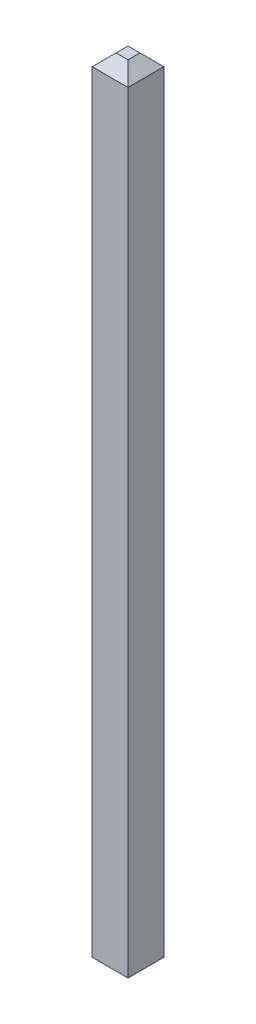
ISO-10303-21;
HEADER;
FILE_DESCRIPTION(('STEP AP214'),'2;1');
FILE_NAME('part.step','',(''),(''),'','','');
FILE_SCHEMA(('AUTOMOTIVE_DESIGN { 1 0 10303 214 1 1 1 1 }'));
ENDSEC;
DATA;
#1=APPLICATION_CONTEXT('core data for automotive mechanical design processes');
#2=APPLICATION_PROTOCOL_DEFINITION('international standard','automotive_design',2000,#1);
#3=PRODUCT_CONTEXT('',#1,'mechanical');
#4=PRODUCT('Part','Part','',(#3));
#5=PRODUCT_RELATED_PRODUCT_CATEGORY('part','',(#4));
#6=PRODUCT_DEFINITION_FORMATION('','',#4);
#7=PRODUCT_DEFINITION_CONTEXT('part definition',#1,'design');
#8=PRODUCT_DEFINITION('design','',#6,#7);
#9=PRODUCT_DEFINITION_SHAPE('','',#8);
#10=(LENGTH_UNIT() NAMED_UNIT(*) SI_UNIT(.MILLI.,.METRE.));
#11=(NAMED_UNIT(*) PLANE_ANGLE_UNIT() SI_UNIT($,.RADIAN.));
#12=(NAMED_UNIT(*) SI_UNIT($,.STERADIAN.) SOLID_ANGLE_UNIT());
#13=UNCERTAINTY_MEASURE_WITH_UNIT(LENGTH_MEASURE(1.E-05),#10,'distance_accuracy_value','');
#14=(GEOMETRIC_REPRESENTATION_CONTEXT(3) GLOBAL_UNCERTAINTY_ASSIGNED_CONTEXT((#13)) GLOBAL_UNIT_ASSIGNED_CONTEXT((#10,
#11,#12)) REPRESENTATION_CONTEXT('',''));
#15=CARTESIAN_POINT('',(0.,0.,0.));
#16=DIRECTION('',(0.,0.,1.));
#17=DIRECTION('',(1.,0.,0.));
#18=AXIS2_PLACEMENT_3D('',#15,#16,#17);
#19=CARTESIAN_POINT('',(0.,-8.3,0.));
#20=DIRECTION('',(0.,1.,0.));
#21=DIRECTION('',(0.,0.,1.));
#22=AXIS2_PLACEMENT_3D('',#19,#20,#21);
#23=PLANE('',#22);
#24=DIRECTION('',(-1.,0.,0.));
#25=VECTOR('',#24,1.);
#26=CARTESIAN_POINT('',(-1.55,-8.3,0.100000000000001));
#27=LINE('',#26,#25);
#28=CARTESIAN_POINT('',(-1.15,-8.3,0.100000000000001));
#29=VERTEX_POINT('',#28);
#30=CARTESIAN_POINT('',(-1.35,-8.3,0.100000000000001));
#31=VERTEX_POINT('',#30);
#32=EDGE_CURVE('E134',#29,#31,#27,.T.);
#33=ORIENTED_EDGE('',*,*,#32,.T.);
#34=DIRECTION('',(0.,0.,-1.));
#35=VECTOR('',#34,1.);
#36=CARTESIAN_POINT('',(-1.35,-8.3,-0.3));
#37=LINE('',#36,#35);
#38=CARTESIAN_POINT('',(-1.35,-8.3,-0.100000000000001));
#39=VERTEX_POINT('',#38);
#40=EDGE_CURVE('E118',#31,#39,#37,.T.);
#41=ORIENTED_EDGE('',*,*,#40,.T.);
#42=DIRECTION('',(1.,0.,0.));
#43=VECTOR('',#42,1.);
#44=CARTESIAN_POINT('',(-0.95,-8.3,-0.100000000000001));
#45=LINE('',#44,#43);
#46=CARTESIAN_POINT('',(-1.15,-8.3,-0.100000000000001));
#47=VERTEX_POINT('',#46);
#48=EDGE_CURVE('E123',#39,#47,#45,.T.);
#49=ORIENTED_EDGE('',*,*,#48,.T.);
#50=DIRECTION('',(0.,0.,1.));
#51=VECTOR('',#50,1.);
#52=CARTESIAN_POINT('',(-1.15,-8.3,0.3));
#53=LINE('',#52,#51);
#54=EDGE_CURVE('E136',#47,#29,#53,.T.);
#55=ORIENTED_EDGE('',*,*,#54,.T.);
#56=EDGE_LOOP('',(#33,#41,#49,#55));
#57=FACE_BOUND('',#56,.T.);
#58=ADVANCED_FACE('F33',(#57),#23,.F.);
#59=CARTESIAN_POINT('',(-1.55,-8.1,-0.3));
#60=DIRECTION('',(-0.707106781186551,-0.707106781186544,0.));
#61=DIRECTION('',(0.,0.,-1.));
#62=AXIS2_PLACEMENT_3D('',#59,#60,#61);
#63=PLANE('',#62);
#64=DIRECTION('',(-0.577350269189624,0.577350269189629,-0.577350269189624));
#65=VECTOR('',#64,1.);
#66=CARTESIAN_POINT('',(-1.55,-8.1,-0.3));
#67=LINE('',#66,#65);
#68=CARTESIAN_POINT('',(-1.55,-8.1,-0.3));
#69=VERTEX_POINT('',#68);
#70=EDGE_CURVE('E121',#69,#39,#67,.F.);
#71=ORIENTED_EDGE('',*,*,#70,.T.);
#72=ORIENTED_EDGE('',*,*,#40,.F.);
#73=DIRECTION('',(0.577350269189624,-0.577350269189629,-0.577350269189624));
#74=VECTOR('',#73,1.);
#75=CARTESIAN_POINT('',(-1.55,-8.1,0.3));
#76=LINE('',#75,#74);
#77=CARTESIAN_POINT('',(-1.55,-8.1,0.3));
#78=VERTEX_POINT('',#77);
#79=EDGE_CURVE('E128',#31,#78,#76,.F.);
#80=ORIENTED_EDGE('',*,*,#79,.T.);
#81=DIRECTION('',(0.,0.,1.));
#82=VECTOR('',#81,1.);
#83=CARTESIAN_POINT('',(-1.55,-8.1,0.3));
#84=LINE('',#83,#82);
#85=EDGE_CURVE('E102',#69,#78,#84,.T.);
#86=ORIENTED_EDGE('',*,*,#85,.F.);
#87=EDGE_LOOP('',(#71,#72,#80,#86));
#88=FACE_BOUND('',#87,.T.);
#89=ADVANCED_FACE('F131',(#88),#63,.T.);
#90=CARTESIAN_POINT('',(-1.55,-8.1,0.3));
#91=DIRECTION('',(0.,-0.707106781186544,0.707106781186551));
#92=DIRECTION('',(-1.,0.,0.));
#93=AXIS2_PLACEMENT_3D('',#90,#91,#92);
#94=PLANE('',#93);
#95=DIRECTION('',(0.577350269189624,0.577350269189629,0.577350269189624));
#96=VECTOR('',#95,1.);
#97=CARTESIAN_POINT('',(-1.15,-8.3,0.100000000000001));
#98=LINE('',#97,#96);
#99=CARTESIAN_POINT('',(-0.95,-8.1,0.3));
#100=VERTEX_POINT('',#99);
#101=EDGE_CURVE('E127',#29,#100,#98,.T.);
#102=ORIENTED_EDGE('',*,*,#101,.T.);
#103=DIRECTION('',(1.,0.,0.));
#104=VECTOR('',#103,1.);
#105=CARTESIAN_POINT('',(-0.95,-8.1,0.3));
#106=LINE('',#105,#104);
#107=EDGE_CURVE('E146',#78,#100,#106,.T.);
#108=ORIENTED_EDGE('',*,*,#107,.F.);
#109=ORIENTED_EDGE('',*,*,#79,.F.);
#110=ORIENTED_EDGE('',*,*,#32,.F.);
#111=EDGE_LOOP('',(#102,#108,#109,#110));
#112=FACE_BOUND('',#111,.T.);
#113=ADVANCED_FACE('F200',(#112),#94,.T.);
#114=CARTESIAN_POINT('',(-0.95,-8.1,-0.3));
#115=DIRECTION('',(0.707106781186551,-0.707106781186544,0.));
#116=DIRECTION('',(0.,0.,1.));
#117=AXIS2_PLACEMENT_3D('',#114,#115,#116);
#118=PLANE('',#117);
#119=ORIENTED_EDGE('',*,*,#101,.F.);
#120=ORIENTED_EDGE('',*,*,#54,.F.);
#121=DIRECTION('',(0.577350269189624,0.577350269189629,-0.577350269189624));
#122=VECTOR('',#121,1.);
#123=CARTESIAN_POINT('',(-0.95,-8.1,-0.3));
#124=LINE('',#123,#122);
#125=CARTESIAN_POINT('',(-0.95,-8.1,-0.3));
#126=VERTEX_POINT('',#125);
#127=EDGE_CURVE('E165',#126,#47,#124,.F.);
#128=ORIENTED_EDGE('',*,*,#127,.F.);
#129=DIRECTION('',(0.,0.,-1.));
#130=VECTOR('',#129,1.);
#131=CARTESIAN_POINT('',(-0.95,-8.1,-0.3));
#132=LINE('',#131,#130);
#133=EDGE_CURVE('E117',#100,#126,#132,.T.);
#134=ORIENTED_EDGE('',*,*,#133,.F.);
#135=EDGE_LOOP('',(#119,#120,#128,#134));
#136=FACE_BOUND('',#135,.T.);
#137=ADVANCED_FACE('F197',(#136),#118,.T.);
#138=CARTESIAN_POINT('',(-1.55,-8.1,-0.3));
#139=DIRECTION('',(0.,-0.707106781186544,-0.707106781186551));
#140=DIRECTION('',(1.,0.,0.));
#141=AXIS2_PLACEMENT_3D('',#138,#139,#140);
#142=PLANE('',#141);
#143=ORIENTED_EDGE('',*,*,#127,.T.);
#144=ORIENTED_EDGE('',*,*,#48,.F.);
#145=ORIENTED_EDGE('',*,*,#70,.F.);
#146=DIRECTION('',(-1.,0.,0.));
#147=VECTOR('',#146,1.);
#148=CARTESIAN_POINT('',(-1.55,-8.1,-0.3));
#149=LINE('',#148,#147);
#150=EDGE_CURVE('E111',#126,#69,#149,.T.);
#151=ORIENTED_EDGE('',*,*,#150,.F.);
#152=EDGE_LOOP('',(#143,#144,#145,#151));
#153=FACE_BOUND('',#152,.T.);
#154=ADVANCED_FACE('F122',(#153),#142,.T.);
#155=CARTESIAN_POINT('',(-1.55,-8.3,-0.3));
#156=DIRECTION('',(0.,0.,-1.));
#157=DIRECTION('',(-1.,0.,0.));
#158=AXIS2_PLACEMENT_3D('',#155,#156,#157);
#159=PLANE('',#158);
#160=DIRECTION('',(0.,1.,0.));
#161=VECTOR('',#160,1.);
#162=CARTESIAN_POINT('',(-0.95,-8.3,-0.3));
#163=LINE('',#162,#161);
#164=CARTESIAN_POINT('',(-0.95,4.8,-0.3));
#165=VERTEX_POINT('',#164);
#166=EDGE_CURVE('E108',#126,#165,#163,.T.);
#167=ORIENTED_EDGE('',*,*,#166,.F.);
#168=ORIENTED_EDGE('',*,*,#150,.T.);
#169=DIRECTION('',(0.,1.,0.));
#170=VECTOR('',#169,1.);
#171=CARTESIAN_POINT('',(-1.55,-8.3,-0.3));
#172=LINE('',#171,#170);
#173=CARTESIAN_POINT('',(-1.55,4.8,-0.3));
#174=VERTEX_POINT('',#173);
#175=EDGE_CURVE('E98',#69,#174,#172,.T.);
#176=ORIENTED_EDGE('',*,*,#175,.T.);
#177=DIRECTION('',(1.,0.,0.));
#178=VECTOR('',#177,1.);
#179=CARTESIAN_POINT('',(-1.55,4.8,-0.3));
#180=LINE('',#179,#178);
#181=EDGE_CURVE('E158',#174,#165,#180,.T.);
#182=ORIENTED_EDGE('',*,*,#181,.T.);
#183=EDGE_LOOP('',(#167,#168,#176,#182));
#184=FACE_BOUND('',#183,.T.);
#185=ADVANCED_FACE('F113',(#184),#159,.T.);
#186=CARTESIAN_POINT('',(-0.95,-8.3,-0.3));
#187=DIRECTION('',(1.,0.,0.));
#188=DIRECTION('',(0.,0.,-1.));
#189=AXIS2_PLACEMENT_3D('',#186,#187,#188);
#190=PLANE('',#189);
#191=DIRECTION('',(0.,1.,0.));
#192=VECTOR('',#191,1.);
#193=CARTESIAN_POINT('',(-0.95,-8.3,0.3));
#194=LINE('',#193,#192);
#195=CARTESIAN_POINT('',(-0.95,4.8,0.3));
#196=VERTEX_POINT('',#195);
#197=EDGE_CURVE('E191',#100,#196,#194,.T.);
#198=ORIENTED_EDGE('',*,*,#197,.F.);
#199=ORIENTED_EDGE('',*,*,#133,.T.);
#200=ORIENTED_EDGE('',*,*,#166,.T.);
#201=DIRECTION('',(0.,0.,1.));
#202=VECTOR('',#201,1.);
#203=CARTESIAN_POINT('',(-0.95,4.8,-0.3));
#204=LINE('',#203,#202);
#205=EDGE_CURVE('E11',#165,#196,#204,.T.);
#206=ORIENTED_EDGE('',*,*,#205,.T.);
#207=EDGE_LOOP('',(#198,#199,#200,#206));
#208=FACE_BOUND('',#207,.T.);
#209=ADVANCED_FACE('F188',(#208),#190,.T.);
#210=CARTESIAN_POINT('',(-1.55,-8.3,0.3));
#211=DIRECTION('',(0.,0.,1.));
#212=DIRECTION('',(1.,0.,0.));
#213=AXIS2_PLACEMENT_3D('',#210,#211,#212);
#214=PLANE('',#213);
#215=DIRECTION('',(0.,1.,0.));
#216=VECTOR('',#215,1.);
#217=CARTESIAN_POINT('',(-1.55,-8.3,0.3));
#218=LINE('',#217,#216);
#219=CARTESIAN_POINT('',(-1.55,4.8,0.3));
#220=VERTEX_POINT('',#219);
#221=EDGE_CURVE('E139',#78,#220,#218,.T.);
#222=ORIENTED_EDGE('',*,*,#221,.F.);
#223=ORIENTED_EDGE('',*,*,#107,.T.);
#224=ORIENTED_EDGE('',*,*,#197,.T.);
#225=DIRECTION('',(-1.,0.,0.));
#226=VECTOR('',#225,1.);
#227=CARTESIAN_POINT('',(-1.55,4.8,0.3));
#228=LINE('',#227,#226);
#229=EDGE_CURVE('E42',#196,#220,#228,.T.);
#230=ORIENTED_EDGE('',*,*,#229,.T.);
#231=EDGE_LOOP('',(#222,#223,#224,#230));
#232=FACE_BOUND('',#231,.T.);
#233=ADVANCED_FACE('F193',(#232),#214,.T.);
#234=CARTESIAN_POINT('',(-1.55,-8.3,-0.3));
#235=DIRECTION('',(-1.,0.,0.));
#236=DIRECTION('',(0.,0.,1.));
#237=AXIS2_PLACEMENT_3D('',#234,#235,#236);
#238=PLANE('',#237);
#239=ORIENTED_EDGE('',*,*,#175,.F.);
#240=ORIENTED_EDGE('',*,*,#85,.T.);
#241=ORIENTED_EDGE('',*,*,#221,.T.);
#242=DIRECTION('',(0.,0.,-1.));
#243=VECTOR('',#242,1.);
#244=CARTESIAN_POINT('',(-1.55,4.8,-0.3));
#245=LINE('',#244,#243);
#246=EDGE_CURVE('E104',#220,#174,#245,.T.);
#247=ORIENTED_EDGE('',*,*,#246,.T.);
#248=EDGE_LOOP('',(#239,#240,#241,#247));
#249=FACE_BOUND('',#248,.T.);
#250=ADVANCED_FACE('F100',(#249),#238,.T.);
#251=CARTESIAN_POINT('',(0.,5.,0.));
#252=DIRECTION('',(0.,1.,0.));
#253=DIRECTION('',(0.,0.,1.));
#254=AXIS2_PLACEMENT_3D('',#251,#252,#253);
#255=PLANE('',#254);
#256=DIRECTION('',(0.,0.,-1.));
#257=VECTOR('',#256,1.);
#258=CARTESIAN_POINT('',(-1.15,5.,0.));
#259=LINE('',#258,#257);
#260=CARTESIAN_POINT('',(-1.15,5.,0.0999999999999995));
#261=VERTEX_POINT('',#260);
#262=CARTESIAN_POINT('',(-1.15,5.,-0.0999999999999995));
#263=VERTEX_POINT('',#262);
#264=EDGE_CURVE('E149',#261,#263,#259,.T.);
#265=ORIENTED_EDGE('',*,*,#264,.T.);
#266=DIRECTION('',(-1.,0.,0.));
#267=VECTOR('',#266,1.);
#268=CARTESIAN_POINT('',(0.,5.,-0.0999999999999995));
#269=LINE('',#268,#267);
#270=CARTESIAN_POINT('',(-1.35,5.,-0.0999999999999995));
#271=VERTEX_POINT('',#270);
#272=EDGE_CURVE('E155',#263,#271,#269,.T.);
#273=ORIENTED_EDGE('',*,*,#272,.T.);
#274=DIRECTION('',(0.,0.,1.));
#275=VECTOR('',#274,1.);
#276=CARTESIAN_POINT('',(-1.35,5.,0.));
#277=LINE('',#276,#275);
#278=CARTESIAN_POINT('',(-1.35,5.,0.0999999999999995));
#279=VERTEX_POINT('',#278);
#280=EDGE_CURVE('E153',#271,#279,#277,.T.);
#281=ORIENTED_EDGE('',*,*,#280,.T.);
#282=DIRECTION('',(1.,0.,0.));
#283=VECTOR('',#282,1.);
#284=CARTESIAN_POINT('',(0.,5.,0.0999999999999995));
#285=LINE('',#284,#283);
#286=EDGE_CURVE('E151',#279,#261,#285,.T.);
#287=ORIENTED_EDGE('',*,*,#286,.T.);
#288=EDGE_LOOP('',(#265,#273,#281,#287));
#289=FACE_BOUND('',#288,.T.);
#290=ADVANCED_FACE('F211',(#289),#255,.T.);
#291=CARTESIAN_POINT('',(0.,5.,0.0999999999999995));
#292=DIRECTION('',(0.,-0.707106781186549,-0.707106781186546));
#293=DIRECTION('',(1.,0.,0.));
#294=AXIS2_PLACEMENT_3D('',#291,#292,#293);
#295=PLANE('',#294);
#296=DIRECTION('',(-0.577350269189627,-0.577350269189624,0.577350269189627));
#297=VECTOR('',#296,1.);
#298=CARTESIAN_POINT('',(-0.899999999999998,5.45,-0.350000000000001));
#299=LINE('',#298,#297);
#300=EDGE_CURVE('E170',#220,#279,#299,.F.);
#301=ORIENTED_EDGE('',*,*,#300,.F.);
#302=ORIENTED_EDGE('',*,*,#229,.F.);
#303=DIRECTION('',(0.577350269189627,-0.577350269189624,0.577350269189627));
#304=VECTOR('',#303,1.);
#305=CARTESIAN_POINT('',(-1.18333333333333,5.03333333333333,0.0666666666666663));
#306=LINE('',#305,#304);
#307=EDGE_CURVE('E37',#261,#196,#306,.T.);
#308=ORIENTED_EDGE('',*,*,#307,.F.);
#309=ORIENTED_EDGE('',*,*,#286,.F.);
#310=EDGE_LOOP('',(#301,#302,#308,#309));
#311=FACE_BOUND('',#310,.T.);
#312=ADVANCED_FACE('F35',(#311),#295,.F.);
#313=CARTESIAN_POINT('',(-1.15,5.,0.));
#314=DIRECTION('',(-0.707106781186546,-0.707106781186549,0.));
#315=DIRECTION('',(0.,0.,-1.));
#316=AXIS2_PLACEMENT_3D('',#313,#314,#315);
#317=PLANE('',#316);
#318=ORIENTED_EDGE('',*,*,#307,.T.);
#319=ORIENTED_EDGE('',*,*,#205,.F.);
#320=DIRECTION('',(-0.577350269189627,0.577350269189624,0.577350269189627));
#321=VECTOR('',#320,1.);
#322=CARTESIAN_POINT('',(-1.18333333333333,5.03333333333333,-0.0666666666666662));
#323=LINE('',#322,#321);
#324=EDGE_CURVE('E169',#263,#165,#323,.F.);
#325=ORIENTED_EDGE('',*,*,#324,.F.);
#326=ORIENTED_EDGE('',*,*,#264,.F.);
#327=EDGE_LOOP('',(#318,#319,#325,#326));
#328=FACE_BOUND('',#327,.T.);
#329=ADVANCED_FACE('F179',(#328),#317,.F.);
#330=CARTESIAN_POINT('',(-1.35,5.,0.));
#331=DIRECTION('',(0.707106781186546,-0.707106781186549,0.));
#332=DIRECTION('',(0.,0.,1.));
#333=AXIS2_PLACEMENT_3D('',#330,#331,#332);
#334=PLANE('',#333);
#335=ORIENTED_EDGE('',*,*,#300,.T.);
#336=ORIENTED_EDGE('',*,*,#280,.F.);
#337=DIRECTION('',(-0.577350269189627,-0.577350269189624,-0.577350269189626));
#338=VECTOR('',#337,1.);
#339=CARTESIAN_POINT('',(-1.31666666666667,5.03333333333333,-0.0666666666666662));
#340=LINE('',#339,#338);
#341=EDGE_CURVE('E167',#174,#271,#340,.F.);
#342=ORIENTED_EDGE('',*,*,#341,.F.);
#343=ORIENTED_EDGE('',*,*,#246,.F.);
#344=EDGE_LOOP('',(#335,#336,#342,#343));
#345=FACE_BOUND('',#344,.T.);
#346=ADVANCED_FACE('F184',(#345),#334,.F.);
#347=CARTESIAN_POINT('',(0.,5.,-0.0999999999999995));
#348=DIRECTION('',(0.,-0.707106781186549,0.707106781186546));
#349=DIRECTION('',(-1.,0.,0.));
#350=AXIS2_PLACEMENT_3D('',#347,#348,#349);
#351=PLANE('',#350);
#352=ORIENTED_EDGE('',*,*,#324,.T.);
#353=ORIENTED_EDGE('',*,*,#181,.F.);
#354=ORIENTED_EDGE('',*,*,#341,.T.);
#355=ORIENTED_EDGE('',*,*,#272,.F.);
#356=EDGE_LOOP('',(#352,#353,#354,#355));
#357=FACE_BOUND('',#356,.T.);
#358=ADVANCED_FACE('F187',(#357),#351,.F.);
#359=CLOSED_SHELL('',(#58,#89,#113,#137,#154,#185,#209,#233,#250,#290,#312,#329,#346,#358));
#360=MANIFOLD_SOLID_BREP('B2',#359);
#361=ADVANCED_BREP_SHAPE_REPRESENTATION('',(#18,#360),#14);
#362=SHAPE_DEFINITION_REPRESENTATION(#9,#361);
ENDSEC;
END-ISO-10303-21;
